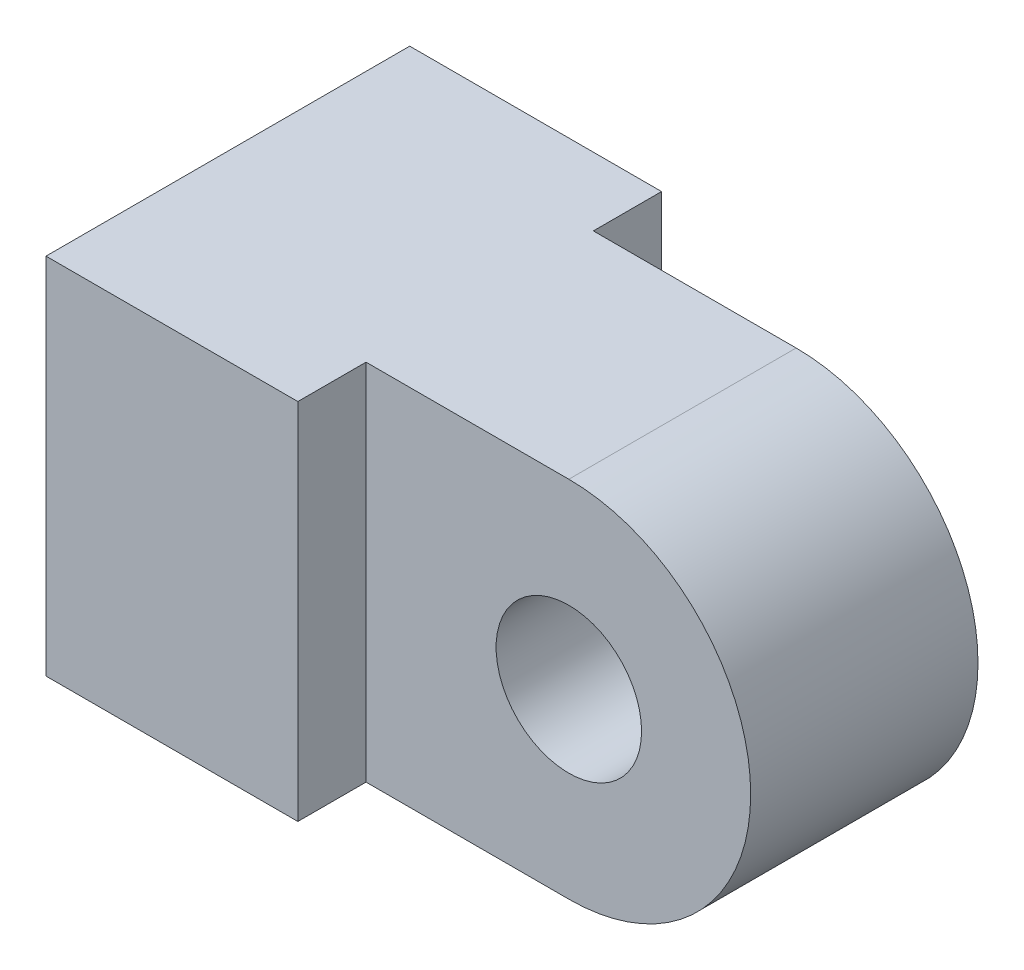
ISO-10303-21;
HEADER;
FILE_DESCRIPTION(('STEP AP214'),'2;1');
FILE_NAME('part.step','',(''),(''),'','','');
FILE_SCHEMA(('AUTOMOTIVE_DESIGN { 1 0 10303 214 1 1 1 1 }'));
ENDSEC;
DATA;
#1=APPLICATION_CONTEXT('core data for automotive mechanical design processes');
#2=APPLICATION_PROTOCOL_DEFINITION('international standard','automotive_design',2000,#1);
#3=PRODUCT_CONTEXT('',#1,'mechanical');
#4=PRODUCT('Part','Part','',(#3));
#5=PRODUCT_RELATED_PRODUCT_CATEGORY('part','',(#4));
#6=PRODUCT_DEFINITION_FORMATION('','',#4);
#7=PRODUCT_DEFINITION_CONTEXT('part definition',#1,'design');
#8=PRODUCT_DEFINITION('design','',#6,#7);
#9=PRODUCT_DEFINITION_SHAPE('','',#8);
#10=(LENGTH_UNIT() NAMED_UNIT(*) SI_UNIT(.MILLI.,.METRE.));
#11=(NAMED_UNIT(*) PLANE_ANGLE_UNIT() SI_UNIT($,.RADIAN.));
#12=(NAMED_UNIT(*) SI_UNIT($,.STERADIAN.) SOLID_ANGLE_UNIT());
#13=UNCERTAINTY_MEASURE_WITH_UNIT(LENGTH_MEASURE(1.E-05),#10,'distance_accuracy_value','');
#14=(GEOMETRIC_REPRESENTATION_CONTEXT(3) GLOBAL_UNCERTAINTY_ASSIGNED_CONTEXT((#13)) GLOBAL_UNIT_ASSIGNED_CONTEXT((#10,
#11,#12)) REPRESENTATION_CONTEXT('',''));
#15=CARTESIAN_POINT('',(0.,0.,0.));
#16=DIRECTION('',(0.,0.,1.));
#17=DIRECTION('',(1.,0.,0.));
#18=AXIS2_PLACEMENT_3D('',#15,#16,#17);
#19=CARTESIAN_POINT('',(0.,0.,0.));
#20=DIRECTION('',(0.,0.,1.));
#21=DIRECTION('',(1.,0.,0.));
#22=AXIS2_PLACEMENT_3D('',#19,#20,#21);
#23=PLANE('',#22);
#24=CARTESIAN_POINT('',(0.,0.,0.));
#25=DIRECTION('',(0.,0.,1.));
#26=DIRECTION('',(1.,0.,0.));
#27=AXIS2_PLACEMENT_3D('',#24,#25,#26);
#28=CIRCLE('',#27,1.6);
#29=CARTESIAN_POINT('',(1.6,0.,0.));
#30=VERTEX_POINT('',#29);
#31=EDGE_CURVE('E141',#30,#30,#28,.T.);
#32=ORIENTED_EDGE('',*,*,#31,.T.);
#33=EDGE_LOOP('',(#32));
#34=FACE_BOUND('',#33,.T.);
#35=DIRECTION('',(0.,-1.,0.));
#36=VECTOR('',#35,1.);
#37=CARTESIAN_POINT('',(-4.46045403024893,4.,0.));
#38=LINE('',#37,#36);
#39=CARTESIAN_POINT('',(-4.46045403024893,4.,0.));
#40=VERTEX_POINT('',#39);
#41=CARTESIAN_POINT('',(-4.46045403024893,-4.,0.));
#42=VERTEX_POINT('',#41);
#43=EDGE_CURVE('E48',#40,#42,#38,.T.);
#44=ORIENTED_EDGE('',*,*,#43,.F.);
#45=DIRECTION('',(-1.,0.,0.));
#46=VECTOR('',#45,1.);
#47=CARTESIAN_POINT('',(0.,4.,0.));
#48=LINE('',#47,#46);
#49=CARTESIAN_POINT('',(0.,4.,0.));
#50=VERTEX_POINT('',#49);
#51=EDGE_CURVE('E119',#50,#40,#48,.T.);
#52=ORIENTED_EDGE('',*,*,#51,.F.);
#53=CARTESIAN_POINT('',(0.,0.,0.));
#54=DIRECTION('',(0.,0.,1.));
#55=DIRECTION('',(1.,0.,0.));
#56=AXIS2_PLACEMENT_3D('',#53,#54,#55);
#57=CIRCLE('',#56,4.);
#58=CARTESIAN_POINT('',(0.,-4.,0.));
#59=VERTEX_POINT('',#58);
#60=EDGE_CURVE('E145',#59,#50,#57,.T.);
#61=ORIENTED_EDGE('',*,*,#60,.F.);
#62=DIRECTION('',(1.,0.,0.));
#63=VECTOR('',#62,1.);
#64=CARTESIAN_POINT('',(0.,-4.,0.));
#65=LINE('',#64,#63);
#66=EDGE_CURVE('E152',#42,#59,#65,.T.);
#67=ORIENTED_EDGE('',*,*,#66,.F.);
#68=EDGE_LOOP('',(#44,#52,#61,#67));
#69=FACE_BOUND('',#68,.T.);
#70=ADVANCED_FACE('F33',(#34,#69),#23,.F.);
#71=CARTESIAN_POINT('',(0.,0.,5.));
#72=DIRECTION('',(0.,0.,1.));
#73=DIRECTION('',(1.,0.,0.));
#74=AXIS2_PLACEMENT_3D('',#71,#72,#73);
#75=PLANE('',#74);
#76=DIRECTION('',(0.,1.,0.));
#77=VECTOR('',#76,1.);
#78=CARTESIAN_POINT('',(-4.46045403024893,4.,5.));
#79=LINE('',#78,#77);
#80=CARTESIAN_POINT('',(-4.46045403024893,-4.,5.));
#81=VERTEX_POINT('',#80);
#82=CARTESIAN_POINT('',(-4.46045403024893,4.,5.));
#83=VERTEX_POINT('',#82);
#84=EDGE_CURVE('E56',#81,#83,#79,.T.);
#85=ORIENTED_EDGE('',*,*,#84,.F.);
#86=DIRECTION('',(1.,0.,0.));
#87=VECTOR('',#86,1.);
#88=CARTESIAN_POINT('',(0.,-4.,5.));
#89=LINE('',#88,#87);
#90=CARTESIAN_POINT('',(0.,-4.,5.));
#91=VERTEX_POINT('',#90);
#92=EDGE_CURVE('E154',#81,#91,#89,.T.);
#93=ORIENTED_EDGE('',*,*,#92,.T.);
#94=CARTESIAN_POINT('',(0.,0.,5.));
#95=DIRECTION('',(0.,0.,1.));
#96=DIRECTION('',(1.,0.,0.));
#97=AXIS2_PLACEMENT_3D('',#94,#95,#96);
#98=CIRCLE('',#97,4.);
#99=CARTESIAN_POINT('',(0.,4.,5.));
#100=VERTEX_POINT('',#99);
#101=EDGE_CURVE('E148',#91,#100,#98,.T.);
#102=ORIENTED_EDGE('',*,*,#101,.T.);
#103=DIRECTION('',(-1.,0.,0.));
#104=VECTOR('',#103,1.);
#105=CARTESIAN_POINT('',(0.,4.,5.));
#106=LINE('',#105,#104);
#107=EDGE_CURVE('E151',#100,#83,#106,.T.);
#108=ORIENTED_EDGE('',*,*,#107,.T.);
#109=EDGE_LOOP('',(#85,#93,#102,#108));
#110=FACE_BOUND('',#109,.T.);
#111=CARTESIAN_POINT('',(0.,0.,5.));
#112=DIRECTION('',(0.,0.,1.));
#113=DIRECTION('',(1.,0.,0.));
#114=AXIS2_PLACEMENT_3D('',#111,#112,#113);
#115=CIRCLE('',#114,1.6);
#116=CARTESIAN_POINT('',(1.6,0.,5.));
#117=VERTEX_POINT('',#116);
#118=EDGE_CURVE('E142',#117,#117,#115,.T.);
#119=ORIENTED_EDGE('',*,*,#118,.F.);
#120=EDGE_LOOP('',(#119));
#121=FACE_BOUND('',#120,.T.);
#122=ADVANCED_FACE('F180',(#110,#121),#75,.T.);
#123=CARTESIAN_POINT('',(0.,0.,5.));
#124=DIRECTION('',(0.,0.,-1.));
#125=DIRECTION('',(-1.,0.,0.));
#126=AXIS2_PLACEMENT_3D('',#123,#124,#125);
#127=CYLINDRICAL_SURFACE('',#126,4.);
#128=ORIENTED_EDGE('',*,*,#60,.T.);
#129=DIRECTION('',(0.,0.,-1.));
#130=VECTOR('',#129,1.);
#131=CARTESIAN_POINT('',(0.,4.,5.));
#132=LINE('',#131,#130);
#133=EDGE_CURVE('E11',#100,#50,#132,.T.);
#134=ORIENTED_EDGE('',*,*,#133,.F.);
#135=ORIENTED_EDGE('',*,*,#101,.F.);
#136=DIRECTION('',(0.,0.,-1.));
#137=VECTOR('',#136,1.);
#138=CARTESIAN_POINT('',(0.,-4.,5.));
#139=LINE('',#138,#137);
#140=EDGE_CURVE('E156',#91,#59,#139,.T.);
#141=ORIENTED_EDGE('',*,*,#140,.T.);
#142=EDGE_LOOP('',(#128,#134,#135,#141));
#143=FACE_BOUND('',#142,.T.);
#144=ADVANCED_FACE('F35',(#143),#127,.T.);
#145=CARTESIAN_POINT('',(0.,4.,5.));
#146=DIRECTION('',(0.,-1.,0.));
#147=DIRECTION('',(1.,0.,0.));
#148=AXIS2_PLACEMENT_3D('',#145,#146,#147);
#149=PLANE('',#148);
#150=ORIENTED_EDGE('',*,*,#51,.T.);
#151=DIRECTION('',(0.,0.,1.));
#152=VECTOR('',#151,1.);
#153=CARTESIAN_POINT('',(-4.46045403024893,4.,-1.5));
#154=LINE('',#153,#152);
#155=CARTESIAN_POINT('',(-4.46045403024893,4.,-1.5));
#156=VERTEX_POINT('',#155);
#157=EDGE_CURVE('E102',#156,#40,#154,.T.);
#158=ORIENTED_EDGE('',*,*,#157,.F.);
#159=DIRECTION('',(1.,0.,0.));
#160=VECTOR('',#159,1.);
#161=CARTESIAN_POINT('',(-10.,4.,-1.5));
#162=LINE('',#161,#160);
#163=CARTESIAN_POINT('',(-10.,4.,-1.5));
#164=VERTEX_POINT('',#163);
#165=EDGE_CURVE('E109',#164,#156,#162,.T.);
#166=ORIENTED_EDGE('',*,*,#165,.F.);
#167=DIRECTION('',(0.,0.,-1.));
#168=VECTOR('',#167,1.);
#169=CARTESIAN_POINT('',(-10.,4.,5.));
#170=LINE('',#169,#168);
#171=CARTESIAN_POINT('',(-10.,4.,6.5));
#172=VERTEX_POINT('',#171);
#173=EDGE_CURVE('E41',#172,#164,#170,.T.);
#174=ORIENTED_EDGE('',*,*,#173,.F.);
#175=DIRECTION('',(-1.,0.,0.));
#176=VECTOR('',#175,1.);
#177=CARTESIAN_POINT('',(-4.46045403024893,4.,6.5));
#178=LINE('',#177,#176);
#179=CARTESIAN_POINT('',(-4.46045403024893,4.,6.5));
#180=VERTEX_POINT('',#179);
#181=EDGE_CURVE('E121',#180,#172,#178,.T.);
#182=ORIENTED_EDGE('',*,*,#181,.F.);
#183=DIRECTION('',(0.,0.,-1.));
#184=VECTOR('',#183,1.);
#185=CARTESIAN_POINT('',(-4.46045403024893,4.,6.5));
#186=LINE('',#185,#184);
#187=EDGE_CURVE('E134',#180,#83,#186,.T.);
#188=ORIENTED_EDGE('',*,*,#187,.T.);
#189=ORIENTED_EDGE('',*,*,#107,.F.);
#190=ORIENTED_EDGE('',*,*,#133,.T.);
#191=EDGE_LOOP('',(#150,#158,#166,#174,#182,#188,#189,#190));
#192=FACE_BOUND('',#191,.T.);
#193=ADVANCED_FACE('F118',(#192),#149,.F.);
#194=CARTESIAN_POINT('',(-10.,4.,5.));
#195=DIRECTION('',(1.,0.,0.));
#196=DIRECTION('',(0.,0.,-1.));
#197=AXIS2_PLACEMENT_3D('',#194,#195,#196);
#198=PLANE('',#197);
#199=ORIENTED_EDGE('',*,*,#173,.T.);
#200=DIRECTION('',(0.,1.,0.));
#201=VECTOR('',#200,1.);
#202=CARTESIAN_POINT('',(-10.,-4.,-1.5));
#203=LINE('',#202,#201);
#204=CARTESIAN_POINT('',(-10.,-4.,-1.5));
#205=VERTEX_POINT('',#204);
#206=EDGE_CURVE('E115',#205,#164,#203,.T.);
#207=ORIENTED_EDGE('',*,*,#206,.F.);
#208=DIRECTION('',(0.,0.,-1.));
#209=VECTOR('',#208,1.);
#210=CARTESIAN_POINT('',(-10.,-4.,5.));
#211=LINE('',#210,#209);
#212=CARTESIAN_POINT('',(-10.,-4.,6.5));
#213=VERTEX_POINT('',#212);
#214=EDGE_CURVE('E163',#213,#205,#211,.T.);
#215=ORIENTED_EDGE('',*,*,#214,.F.);
#216=DIRECTION('',(0.,-1.,0.));
#217=VECTOR('',#216,1.);
#218=CARTESIAN_POINT('',(-10.,4.,6.5));
#219=LINE('',#218,#217);
#220=EDGE_CURVE('E128',#172,#213,#219,.T.);
#221=ORIENTED_EDGE('',*,*,#220,.F.);
#222=EDGE_LOOP('',(#199,#207,#215,#221));
#223=FACE_BOUND('',#222,.T.);
#224=ADVANCED_FACE('F166',(#223),#198,.F.);
#225=CARTESIAN_POINT('',(0.,-4.,5.));
#226=DIRECTION('',(0.,1.,0.));
#227=DIRECTION('',(-1.,0.,0.));
#228=AXIS2_PLACEMENT_3D('',#225,#226,#227);
#229=PLANE('',#228);
#230=ORIENTED_EDGE('',*,*,#214,.T.);
#231=DIRECTION('',(-1.,0.,0.));
#232=VECTOR('',#231,1.);
#233=CARTESIAN_POINT('',(-4.46045403024893,-4.,-1.5));
#234=LINE('',#233,#232);
#235=CARTESIAN_POINT('',(-4.46045403024893,-4.,-1.5));
#236=VERTEX_POINT('',#235);
#237=EDGE_CURVE('E108',#236,#205,#234,.T.);
#238=ORIENTED_EDGE('',*,*,#237,.F.);
#239=DIRECTION('',(0.,0.,1.));
#240=VECTOR('',#239,1.);
#241=CARTESIAN_POINT('',(-4.46045403024893,-4.,-1.5));
#242=LINE('',#241,#240);
#243=EDGE_CURVE('E104',#236,#42,#242,.T.);
#244=ORIENTED_EDGE('',*,*,#243,.T.);
#245=ORIENTED_EDGE('',*,*,#66,.T.);
#246=ORIENTED_EDGE('',*,*,#140,.F.);
#247=ORIENTED_EDGE('',*,*,#92,.F.);
#248=DIRECTION('',(0.,0.,-1.));
#249=VECTOR('',#248,1.);
#250=CARTESIAN_POINT('',(-4.46045403024893,-4.,6.5));
#251=LINE('',#250,#249);
#252=CARTESIAN_POINT('',(-4.46045403024893,-4.,6.5));
#253=VERTEX_POINT('',#252);
#254=EDGE_CURVE('E138',#253,#81,#251,.T.);
#255=ORIENTED_EDGE('',*,*,#254,.F.);
#256=DIRECTION('',(1.,0.,0.));
#257=VECTOR('',#256,1.);
#258=CARTESIAN_POINT('',(-10.,-4.,6.5));
#259=LINE('',#258,#257);
#260=EDGE_CURVE('E131',#213,#253,#259,.T.);
#261=ORIENTED_EDGE('',*,*,#260,.F.);
#262=EDGE_LOOP('',(#230,#238,#244,#245,#246,#247,#255,#261));
#263=FACE_BOUND('',#262,.T.);
#264=ADVANCED_FACE('F177',(#263),#229,.F.);
#265=CARTESIAN_POINT('',(0.,0.,5.));
#266=DIRECTION('',(0.,0.,-1.));
#267=DIRECTION('',(-1.,0.,0.));
#268=AXIS2_PLACEMENT_3D('',#265,#266,#267);
#269=CYLINDRICAL_SURFACE('',#268,1.6);
#270=ORIENTED_EDGE('',*,*,#118,.T.);
#271=EDGE_LOOP('',(#270));
#272=FACE_BOUND('',#271,.T.);
#273=ORIENTED_EDGE('',*,*,#31,.F.);
#274=EDGE_LOOP('',(#273));
#275=FACE_BOUND('',#274,.T.);
#276=ADVANCED_FACE('F198',(#272,#275),#269,.F.);
#277=CARTESIAN_POINT('',(-4.46045403024893,4.,6.5));
#278=DIRECTION('',(-1.,0.,0.));
#279=DIRECTION('',(0.,0.,1.));
#280=AXIS2_PLACEMENT_3D('',#277,#278,#279);
#281=PLANE('',#280);
#282=ORIENTED_EDGE('',*,*,#84,.T.);
#283=ORIENTED_EDGE('',*,*,#187,.F.);
#284=DIRECTION('',(0.,1.,0.));
#285=VECTOR('',#284,1.);
#286=CARTESIAN_POINT('',(-4.46045403024893,4.,6.5));
#287=LINE('',#286,#285);
#288=EDGE_CURVE('E133',#253,#180,#287,.T.);
#289=ORIENTED_EDGE('',*,*,#288,.F.);
#290=ORIENTED_EDGE('',*,*,#254,.T.);
#291=EDGE_LOOP('',(#282,#283,#289,#290));
#292=FACE_BOUND('',#291,.T.);
#293=ADVANCED_FACE('F175',(#292),#281,.F.);
#294=CARTESIAN_POINT('',(0.,0.,6.5));
#295=DIRECTION('',(0.,0.,1.));
#296=DIRECTION('',(1.,0.,0.));
#297=AXIS2_PLACEMENT_3D('',#294,#295,#296);
#298=PLANE('',#297);
#299=ORIENTED_EDGE('',*,*,#181,.T.);
#300=ORIENTED_EDGE('',*,*,#220,.T.);
#301=ORIENTED_EDGE('',*,*,#260,.T.);
#302=ORIENTED_EDGE('',*,*,#288,.T.);
#303=EDGE_LOOP('',(#299,#300,#301,#302));
#304=FACE_BOUND('',#303,.T.);
#305=ADVANCED_FACE('F170',(#304),#298,.T.);
#306=CARTESIAN_POINT('',(-4.46045403024893,4.,-1.5));
#307=DIRECTION('',(-1.,0.,0.));
#308=DIRECTION('',(0.,0.,1.));
#309=AXIS2_PLACEMENT_3D('',#306,#307,#308);
#310=PLANE('',#309);
#311=ORIENTED_EDGE('',*,*,#43,.T.);
#312=ORIENTED_EDGE('',*,*,#243,.F.);
#313=DIRECTION('',(0.,-1.,0.));
#314=VECTOR('',#313,1.);
#315=CARTESIAN_POINT('',(-4.46045403024893,4.,-1.5));
#316=LINE('',#315,#314);
#317=EDGE_CURVE('E98',#156,#236,#316,.T.);
#318=ORIENTED_EDGE('',*,*,#317,.F.);
#319=ORIENTED_EDGE('',*,*,#157,.T.);
#320=EDGE_LOOP('',(#311,#312,#318,#319));
#321=FACE_BOUND('',#320,.T.);
#322=ADVANCED_FACE('F100',(#321),#310,.F.);
#323=CARTESIAN_POINT('',(0.,0.,-1.5));
#324=DIRECTION('',(0.,0.,-1.));
#325=DIRECTION('',(-1.,0.,0.));
#326=AXIS2_PLACEMENT_3D('',#323,#324,#325);
#327=PLANE('',#326);
#328=ORIENTED_EDGE('',*,*,#165,.T.);
#329=ORIENTED_EDGE('',*,*,#317,.T.);
#330=ORIENTED_EDGE('',*,*,#237,.T.);
#331=ORIENTED_EDGE('',*,*,#206,.T.);
#332=EDGE_LOOP('',(#328,#329,#330,#331));
#333=FACE_BOUND('',#332,.T.);
#334=ADVANCED_FACE('F113',(#333),#327,.T.);
#335=CLOSED_SHELL('',(#70,#122,#144,#193,#224,#264,#276,#293,#305,#322,#334));
#336=MANIFOLD_SOLID_BREP('B2',#335);
#337=ADVANCED_BREP_SHAPE_REPRESENTATION('',(#18,#336),#14);
#338=SHAPE_DEFINITION_REPRESENTATION(#9,#337);
ENDSEC;
END-ISO-10303-21;
